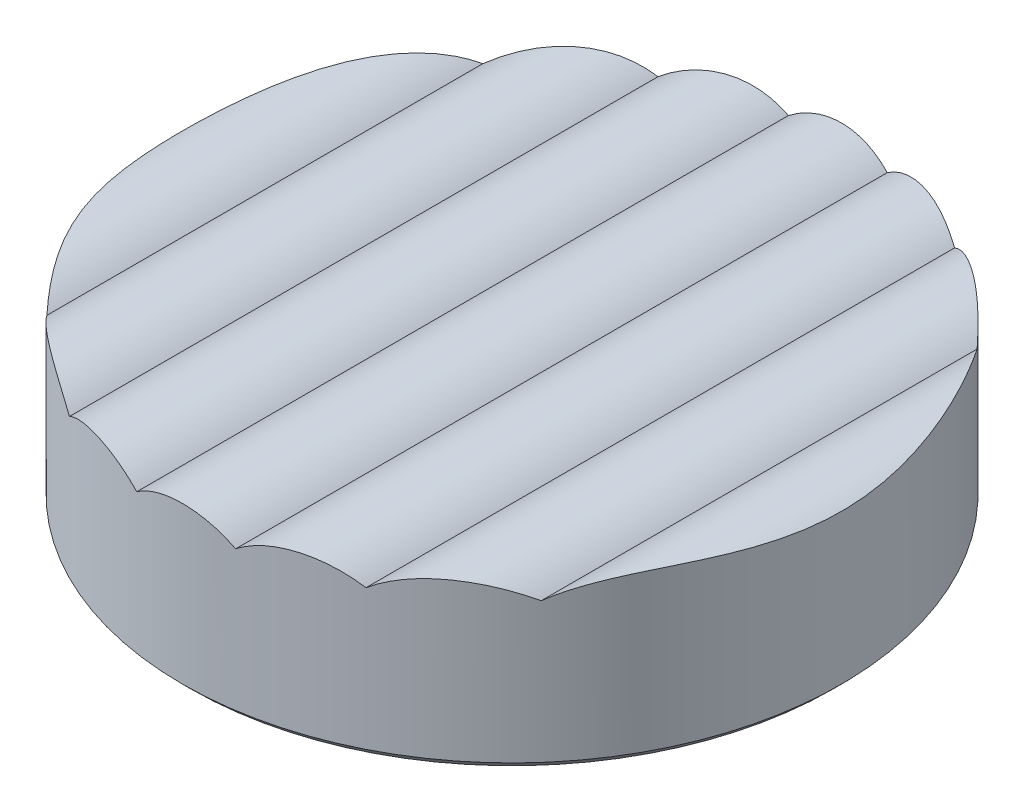
ISO-10303-21;
HEADER;
FILE_DESCRIPTION(('STEP AP214'),'2;1');
FILE_NAME('part.step','',(''),(''),'','','');
FILE_SCHEMA(('AUTOMOTIVE_DESIGN { 1 0 10303 214 1 1 1 1 }'));
ENDSEC;
DATA;
#1=APPLICATION_CONTEXT('core data for automotive mechanical design processes');
#2=APPLICATION_PROTOCOL_DEFINITION('international standard','automotive_design',2000,#1);
#3=PRODUCT_CONTEXT('',#1,'mechanical');
#4=PRODUCT('Part','Part','',(#3));
#5=PRODUCT_RELATED_PRODUCT_CATEGORY('part','',(#4));
#6=PRODUCT_DEFINITION_FORMATION('','',#4);
#7=PRODUCT_DEFINITION_CONTEXT('part definition',#1,'design');
#8=PRODUCT_DEFINITION('design','',#6,#7);
#9=PRODUCT_DEFINITION_SHAPE('','',#8);
#10=(LENGTH_UNIT() NAMED_UNIT(*) SI_UNIT(.MILLI.,.METRE.));
#11=(NAMED_UNIT(*) PLANE_ANGLE_UNIT() SI_UNIT($,.RADIAN.));
#12=(NAMED_UNIT(*) SI_UNIT($,.STERADIAN.) SOLID_ANGLE_UNIT());
#13=UNCERTAINTY_MEASURE_WITH_UNIT(LENGTH_MEASURE(1.E-05),#10,'distance_accuracy_value','');
#14=(GEOMETRIC_REPRESENTATION_CONTEXT(3) GLOBAL_UNCERTAINTY_ASSIGNED_CONTEXT((#13)) GLOBAL_UNIT_ASSIGNED_CONTEXT((#10,
#11,#12)) REPRESENTATION_CONTEXT('',''));
#15=CARTESIAN_POINT('',(0.,0.,0.));
#16=DIRECTION('',(0.,0.,1.));
#17=DIRECTION('',(1.,0.,0.));
#18=AXIS2_PLACEMENT_3D('',#15,#16,#17);
#19=CARTESIAN_POINT('',(0.,2.,0.));
#20=DIRECTION('',(0.,-1.,0.));
#21=DIRECTION('',(0.,0.,-1.));
#22=AXIS2_PLACEMENT_3D('',#19,#20,#21);
#23=CYLINDRICAL_SURFACE('',#22,4.);
#24=CARTESIAN_POINT('',(0.,0.100000000000001,0.));
#25=DIRECTION('',(0.,1.,0.));
#26=DIRECTION('',(0.,0.,1.));
#27=AXIS2_PLACEMENT_3D('',#24,#25,#26);
#28=CIRCLE('',#27,4.);
#29=CARTESIAN_POINT('',(0.,0.100000000000001,4.));
#30=VERTEX_POINT('',#29);
#31=EDGE_CURVE('E43',#30,#30,#28,.T.);
#32=ORIENTED_EDGE('',*,*,#31,.T.);
#33=EDGE_LOOP('',(#32));
#34=FACE_BOUND('',#33,.T.);
#35=CARTESIAN_POINT('',(-0.600000000000006,1.8,3.95474398665704));
#36=CARTESIAN_POINT('',(-0.62232941467402,1.81674786786321,3.95135681522682));
#37=CARTESIAN_POINT('',(-0.645321420618863,1.83252928491137,3.94767419977861));
#38=CARTESIAN_POINT('',(-0.692457273765009,1.86207565364581,3.9396794860719));
#39=CARTESIAN_POINT('',(-0.71660093355104,1.87584093195587,3.93536749000244));
#40=CARTESIAN_POINT('',(-0.790345142406715,1.91390948997767,3.92145899899357));
#41=CARTESIAN_POINT('',(-0.841411243888484,1.93509905569148,3.91086775564437));
#42=CARTESIAN_POINT('',(-0.945708150151169,1.96868070112807,3.88696555055375));
#43=CARTESIAN_POINT('',(-0.998938881065597,1.98107308078286,3.87365468155541));
#44=CARTESIAN_POINT('',(-1.10601002951169,1.99704341166832,3.84445325279022));
#45=CARTESIAN_POINT('',(-1.15985053308358,2.00062010301943,3.82856232464433));
#46=CARTESIAN_POINT('',(-1.26821159182471,1.99918361827415,3.79406956151264));
#47=CARTESIAN_POINT('',(-1.32270797293017,1.99392337626185,3.77540350670449));
#48=CARTESIAN_POINT('',(-1.4295350405246,1.97481349408842,3.73626464396623));
#49=CARTESIAN_POINT('',(-1.48186391852533,1.96095682947294,3.71579037021977));
#50=CARTESIAN_POINT('',(-1.58064952709579,1.9261264054983,3.67481312390131));
#51=CARTESIAN_POINT('',(-1.62726942020847,1.90554843649911,3.65436407119772));
#52=CARTESIAN_POINT('',(-1.71666831436955,1.85768199892992,3.613240778344));
#53=CARTESIAN_POINT('',(-1.75945545517311,1.83040823492381,3.59256712526228));
#54=CARTESIAN_POINT('',(-1.80000000000001,1.79999999999999,3.57211421989835));
#55=B_SPLINE_CURVE_WITH_KNOTS('',3,(#35,#36,#37,#38,#39,#40,#41,#42,#43,#44,#45,#46,#47,#48,#49,
#50,#51,#52,#53,#54),.UNSPECIFIED.,.F.,.F.,(4,2,2,2,2,2,2,2,2,4),(0.,0.0842978724085016,
0.16858207303078,0.336584111740341,0.504580422299046,0.67260074038181,0.845397208673373,
1.01833506165842,1.18251845702741,1.34634446665896),.UNSPECIFIED.);
#56=CARTESIAN_POINT('',(-0.600000000000006,1.8,3.95474398665704));
#57=VERTEX_POINT('',#56);
#58=CARTESIAN_POINT('',(-1.80000000000001,1.79999999999999,3.57211421989835));
#59=VERTEX_POINT('',#58);
#60=EDGE_CURVE('E254',#57,#59,#55,.T.);
#61=ORIENTED_EDGE('',*,*,#60,.T.);
#62=CARTESIAN_POINT('',(-1.8,1.79999999999999,3.57211421989835));
#63=CARTESIAN_POINT('',(-1.82419383073003,1.81814746587049,3.55992498858284));
#64=CARTESIAN_POINT('',(-1.84899294122477,1.83502924581072,3.54711784746098));
#65=CARTESIAN_POINT('',(-1.89950402563079,1.86624714952607,3.52032656296078));
#66=CARTESIAN_POINT('',(-1.92521514897336,1.88058557410132,3.50634350041667));
#67=CARTESIAN_POINT('',(-2.00293711991751,1.91960877689773,3.46290799234863));
#68=CARTESIAN_POINT('',(-2.05591792995748,1.94058079412006,3.43177980895558));
#69=CARTESIAN_POINT('',(-2.16216475679204,1.97289045409109,3.3658505444282));
#70=CARTESIAN_POINT('',(-2.21542925887783,1.98425961049609,3.33106190185304));
#71=CARTESIAN_POINT('',(-2.32105374800024,1.99830408419819,3.25834793166942));
#72=CARTESIAN_POINT('',(-2.37341187426008,2.00096323833908,3.22041690626434));
#73=CARTESIAN_POINT('',(-2.48431637042418,1.99822062499435,3.13588568428949));
#74=CARTESIAN_POINT('',(-2.5425088197709,1.99145794408126,3.08887066237391));
#75=CARTESIAN_POINT('',(-2.65511409351,1.96861757152844,2.99263540660609));
#76=CARTESIAN_POINT('',(-2.70952473531241,1.95253455003176,2.94341392585751));
#77=CARTESIAN_POINT('',(-2.80462950492763,1.91564117608675,2.85264241600385));
#78=CARTESIAN_POINT('',(-2.84604214981671,1.89618015171496,2.81128479000239));
#79=CARTESIAN_POINT('',(-2.92552942598229,1.85197567915462,2.72847706493548));
#80=CARTESIAN_POINT('',(-2.96361439857183,1.82724948140559,2.68702769505247));
#81=CARTESIAN_POINT('',(-3.00000000000001,1.79999999999998,2.64575131106458));
#82=B_SPLINE_CURVE_WITH_KNOTS('',3,(#62,#63,#64,#65,#66,#67,#68,#69,#70,#71,#72,#73,#74,#75,#76,
#77,#78,#79,#80,#81),.UNSPECIFIED.,.F.,.F.,(4,2,2,2,2,2,2,2,2,4),(0.,0.0977440746941684,
0.195399270962096,0.389203476285592,0.582369176629661,0.775893132198266,1.00044804934464,
1.22513150559945,1.4098580997834,1.59398853342984),.UNSPECIFIED.);
#83=CARTESIAN_POINT('',(-3.00000000000001,1.79999999999998,2.64575131106458));
#84=VERTEX_POINT('',#83);
#85=EDGE_CURVE('E232',#59,#84,#82,.T.);
#86=ORIENTED_EDGE('',*,*,#85,.T.);
#87=CARTESIAN_POINT('',(-3.00000000000001,1.79999999999998,2.64575131106458));
#88=CARTESIAN_POINT('',(-3.02532275092012,1.81898297437125,2.61704688694098));
#89=CARTESIAN_POINT('',(-3.05076706313692,1.83619940461668,2.5873554817303));
#90=CARTESIAN_POINT('',(-3.10150692265492,1.86740565335313,2.52630512950817));
#91=CARTESIAN_POINT('',(-3.12680266080136,1.88140154303974,2.4949494595804));
#92=CARTESIAN_POINT('',(-3.20143501705499,1.91881653282672,2.39943215754932));
#93=CARTESIAN_POINT('',(-3.25012971974909,1.93809368565252,2.33313143978897));
#94=CARTESIAN_POINT('',(-3.33687237068017,1.96566327792682,2.20686351577945));
#95=CARTESIAN_POINT('',(-3.37541060633351,1.97518364460663,2.14747527860394));
#96=CARTESIAN_POINT('',(-3.44952161463508,1.98933262178707,2.02628803236811));
#97=CARTESIAN_POINT('',(-3.48509295589765,1.9939588835461,1.96448788053829));
#98=CARTESIAN_POINT('',(-3.5531965246632,1.99949284200429,1.83846906982862));
#99=CARTESIAN_POINT('',(-3.58570270562235,2.00037106551433,1.77423523495239));
#100=CARTESIAN_POINT('',(-3.64719819543476,1.99935829875944,1.64411883640184));
#101=CARTESIAN_POINT('',(-3.67618638462862,1.99746642935624,1.57823575583328));
#102=CARTESIAN_POINT('',(-3.74556607469779,1.99026023076356,1.40826189250557));
#103=CARTESIAN_POINT('',(-3.78340521769221,1.98363224829508,1.30317905279292));
#104=CARTESIAN_POINT('',(-3.85015722497544,1.96880817539028,1.09029633746688));
#105=CARTESIAN_POINT('',(-3.87906567865454,1.96061131335568,0.982495147674203));
#106=CARTESIAN_POINT('',(-3.92771252216949,1.94512219611504,0.765135900374955));
#107=CARTESIAN_POINT('',(-3.94748020396065,1.93782710698741,0.655584635198466));
#108=CARTESIAN_POINT('',(-3.97782278722801,1.92602255784405,0.43509061476965));
#109=CARTESIAN_POINT('',(-3.98840062086589,1.92151220944718,0.324148314817562));
#110=CARTESIAN_POINT('',(-4.00025876454389,1.91642586725403,0.101669984372672));
#111=CARTESIAN_POINT('',(-4.00153911718843,1.91584985542921,-0.00986604339710964));
#112=CARTESIAN_POINT('',(-3.99478521860209,1.91878023041467,-0.232615125980815));
#113=CARTESIAN_POINT('',(-3.98674947082828,1.92228727312921,-0.343828126025989));
#114=CARTESIAN_POINT('',(-3.96142653649884,1.93249914292885,-0.565291360750933));
#115=CARTESIAN_POINT('',(-3.9441181211036,1.93921130396236,-0.675538793867225));
#116=CARTESIAN_POINT('',(-3.90038695866971,1.95409617359652,-0.894091752950589));
#117=CARTESIAN_POINT('',(-3.87396546235677,1.96226868169755,-1.00239754325393));
#118=CARTESIAN_POINT('',(-3.81874086248705,1.97610379384832,-1.19369677750131));
#119=CARTESIAN_POINT('',(-3.79164006567853,1.98193049154993,-1.27717365975343));
#120=CARTESIAN_POINT('',(-3.73196958589824,1.99171506776448,-1.44225602530675));
#121=CARTESIAN_POINT('',(-3.69940109294003,1.99567335221415,-1.5238619114367));
#122=CARTESIAN_POINT('',(-3.62897234823051,2.00020246025262,-1.68471140652661));
#123=CARTESIAN_POINT('',(-3.59112119271194,2.00077903490742,-1.76395879787826));
#124=CARTESIAN_POINT('',(-3.51035534015583,1.99679277437841,-1.91965777624241));
#125=CARTESIAN_POINT('',(-3.46744457906422,1.99223391082253,-1.99611147664733));
#126=CARTESIAN_POINT('',(-3.36917758101673,1.97449538183206,-2.15850339290627));
#127=CARTESIAN_POINT('',(-3.31295399922843,1.9599565644958,-2.24378410886497));
#128=CARTESIAN_POINT('',(-3.19607843063396,1.91689293851651,-2.40729081193502));
#129=CARTESIAN_POINT('',(-3.13545052970576,1.88843994575538,-2.48555060777778));
#130=CARTESIAN_POINT('',(-3.06212107090235,1.84314770151563,-2.57367500684651));
#131=CARTESIAN_POINT('',(-3.04968183071495,1.83509001977703,-2.5883991341227));
#132=CARTESIAN_POINT('',(-3.02481639809621,1.81816306588431,-2.6174121628991));
#133=CARTESIAN_POINT('',(-3.01239022812661,1.80929305545708,-2.63170065244002));
#134=CARTESIAN_POINT('',(-2.99999999999968,1.80000000000243,-2.64575131106557));
#135=B_SPLINE_CURVE_WITH_KNOTS('',3,(#87,#88,#89,#90,#91,#92,#93,#94,#95,#96,#97,#98,#99,#100,
#101,#102,#103,#104,#105,#106,#107,#108,#109,#110,#111,#112,#113,#114,#115,#116,#117,#118,#119,
#120,#121,#122,#123,#124,#125,#126,#127,#128,#129,#130,#131,#132,#133,#134),.UNSPECIFIED.,.F.,
.F.,(4,2,2,2,2,2,2,2,2,2,2,2,2,2,2,2,2,2,2,2,2,2,2,4),(0.,0.128053380280924,0.255863346341465,
0.508464758445938,0.722491335134044,0.936620579297172,1.15243058957271,1.36830910584166,
1.70350090393499,2.03885797991289,2.37313281387339,2.70730095312215,3.04146756109076,
3.37568785718634,3.71067660749811,4.04561940052741,4.30931011690571,4.57294351669621,
4.83612844106956,5.09910996402841,5.40774399516551,5.71480160890944,5.77746108708178,
5.8401780885042),.UNSPECIFIED.);
#136=CARTESIAN_POINT('',(-3.00000000000001,1.79999999999998,-2.64575131106458));
#137=VERTEX_POINT('',#136);
#138=EDGE_CURVE('E231',#84,#137,#135,.T.);
#139=ORIENTED_EDGE('',*,*,#138,.T.);
#140=CARTESIAN_POINT('',(-3.00000000000001,1.79999999999998,-2.64575131106458));
#141=CARTESIAN_POINT('',(-2.97506551177646,1.81868984845977,-2.67402628110174));
#142=CARTESIAN_POINT('',(-2.9493442942952,1.83617095025798,-2.70238302041516));
#143=CARTESIAN_POINT('',(-2.89636339979781,1.86867374204349,-2.75909128206226));
#144=CARTESIAN_POINT('',(-2.86910316425591,1.88369453134188,-2.78744279870684));
#145=CARTESIAN_POINT('',(-2.78476802571609,1.92514487079185,-2.87253460623489));
#146=CARTESIAN_POINT('',(-2.72543060190112,1.94774299037218,-2.92897800126589));
#147=CARTESIAN_POINT('',(-2.6028699911324,1.98122054303626,-3.03836776941551));
#148=CARTESIAN_POINT('',(-2.53975577026652,1.99233812010322,-3.09136289755331));
#149=CARTESIAN_POINT('',(-2.40978563987849,2.00206340231027,-3.19370193747555));
#150=CARTESIAN_POINT('',(-2.3429380604804,2.00069793286865,-3.24305344907163));
#151=CARTESIAN_POINT('',(-2.2201861114014,1.98526558786029,-3.32795304329386));
#152=CARTESIAN_POINT('',(-2.16457060221939,1.97361941183808,-3.36435737212451));
#153=CARTESIAN_POINT('',(-2.0539536939537,1.93998610698188,-3.43299894328624));
#154=CARTESIAN_POINT('',(-1.99895115038748,1.91802359401632,-3.46524587342162));
#155=CARTESIAN_POINT('',(-1.92037765800917,1.87792646061083,-3.50898560052015));
#156=CARTESIAN_POINT('',(-1.89567090217278,1.86398484339932,-3.52238355052124));
#157=CARTESIAN_POINT('',(-1.84712266296259,1.83375322801287,-3.54808293606736));
#158=CARTESIAN_POINT('',(-1.82328157710792,1.81746216761749,-3.56038387154162));
#159=CARTESIAN_POINT('',(-1.8,1.79999999999999,-3.57211421989835));
#160=B_SPLINE_CURVE_WITH_KNOTS('',3,(#140,#141,#142,#143,#144,#145,#146,#147,#148,#149,#150,
#151,#152,#153,#154,#155,#156,#157,#158,#159),.UNSPECIFIED.,.F.,.F.,(4,2,2,2,2,2,2,2,2,4),(0.,
0.126175619127698,0.252397326791968,0.506313160860678,0.754849180602281,1.00285123510904,
1.20451843665788,1.40570686455692,1.49972391449845,1.59378360507382),.UNSPECIFIED.);
#161=CARTESIAN_POINT('',(-1.80000000000001,1.79999999999999,-3.57211421989835));
#162=VERTEX_POINT('',#161);
#163=EDGE_CURVE('E249',#137,#162,#160,.T.);
#164=ORIENTED_EDGE('',*,*,#163,.T.);
#165=CARTESIAN_POINT('',(-1.80000000000001,1.79999999999999,-3.57211421989835));
#166=CARTESIAN_POINT('',(-1.75227156123367,1.83580346896344,-3.59621059781359));
#167=CARTESIAN_POINT('',(-1.70140908252971,1.86726712356151,-3.62059734840253));
#168=CARTESIAN_POINT('',(-1.59455131570657,1.92081983825646,-3.66889128701518));
#169=CARTESIAN_POINT('',(-1.5385417649097,1.94288183186804,-3.69279690415961));
#170=CARTESIAN_POINT('',(-1.42273217956607,1.97674614264018,-3.73894963955378));
#171=CARTESIAN_POINT('',(-1.36292697061972,1.98853411691379,-3.76119439973169));
#172=CARTESIAN_POINT('',(-1.24132341159941,2.00100899803634,-3.8030557274932));
#173=CARTESIAN_POINT('',(-1.17952774922556,2.0017102934007,-3.82267566880472));
#174=CARTESIAN_POINT('',(-1.05912273489741,1.99177317533639,-3.85771848005466));
#175=CARTESIAN_POINT('',(-1.00051327263593,1.98171720560232,-3.87330552178808));
#176=CARTESIAN_POINT('',(-0.885318053967095,1.95106074199438,-3.90124528419948));
#177=CARTESIAN_POINT('',(-0.828730500381032,1.93046987478255,-3.91360094212739));
#178=CARTESIAN_POINT('',(-0.74364433316159,1.89044313812726,-3.93039131847611));
#179=CARTESIAN_POINT('',(-0.713696931813514,1.87445018768265,-3.93592529472295));
#180=CARTESIAN_POINT('',(-0.655504473861233,1.83945011840746,-3.94603433072461));
#181=CARTESIAN_POINT('',(-0.627257132361761,1.82044717578746,-3.95061069898747));
#182=CARTESIAN_POINT('',(-0.600000000000006,1.8,-3.95474398665704));
#183=B_SPLINE_CURVE_WITH_KNOTS('',3,(#165,#166,#167,#168,#169,#170,#171,#172,#173,#174,#175,
#176,#177,#178,#179,#180,#181,#182),.UNSPECIFIED.,.F.,.F.,(4,2,2,2,2,2,2,2,4),(0.,
0.192857309553522,0.386266146301152,0.579944557982606,0.773371589251381,0.956831828954271,
1.14012472353053,1.24315081717614,1.34603519966624),.UNSPECIFIED.);
#184=CARTESIAN_POINT('',(-0.600000000000006,1.8,-3.95474398665704));
#185=VERTEX_POINT('',#184);
#186=EDGE_CURVE('E259',#162,#185,#183,.T.);
#187=ORIENTED_EDGE('',*,*,#186,.T.);
#188=CARTESIAN_POINT('',(-0.600000000000006,1.8,-3.95474398665704));
#189=CARTESIAN_POINT('',(-0.577844649172212,1.81661540894773,-3.95810564238813));
#190=CARTESIAN_POINT('',(-0.555001612618738,1.83230976205425,-3.96138020716267));
#191=CARTESIAN_POINT('',(-0.508063555079729,1.86176592977546,-3.9676734847896));
#192=CARTESIAN_POINT('',(-0.483968337981698,1.87552744041733,-3.97069215736901));
#193=CARTESIAN_POINT('',(-0.410050821978176,1.91374351278229,-3.97923439789681));
#194=CARTESIAN_POINT('',(-0.358550777217911,1.93516400795038,-3.98425140685193));
#195=CARTESIAN_POINT('',(-0.256355427043799,1.96796635764045,-3.99208257857569));
#196=CARTESIAN_POINT('',(-0.205861041415163,1.97995129829428,-3.99502749551122));
#197=CARTESIAN_POINT('',(-0.103578671135372,1.99596546825927,-3.99898570621672));
#198=CARTESIAN_POINT('',(-0.0517916337814237,2.00000035978003,-4.00000037473667));
#199=CARTESIAN_POINT('',(0.0552453962364944,1.99999961622778,-3.99999960027375));
#200=CARTESIAN_POINT('',(0.110496022372873,1.99540784916397,-3.99884426562491));
#201=CARTESIAN_POINT('',(0.219447729182588,1.97718869515677,-3.99434890951521));
#202=CARTESIAN_POINT('',(0.273147226500213,1.96355239381738,-3.99100673272172));
#203=CARTESIAN_POINT('',(0.374630217362695,1.92864034963019,-3.982724705952));
#204=CARTESIAN_POINT('',(0.422576506126463,1.90781184312188,-3.97787978926634));
#205=CARTESIAN_POINT('',(0.51451134041511,1.85906855273318,-3.96704728817116));
#206=CARTESIAN_POINT('',(0.558504309419477,1.83116182601872,-3.96106100489464));
#207=CARTESIAN_POINT('',(0.6,1.8,-3.95474398665704));
#208=B_SPLINE_CURVE_WITH_KNOTS('',3,(#188,#189,#190,#191,#192,#193,#194,#195,#196,#197,#198,
#199,#200,#201,#202,#203,#204,#205,#206,#207),.UNSPECIFIED.,.F.,.F.,(4,2,2,2,2,2,2,2,2,4),(0.,
0.0836402074522525,0.167293554076855,0.334429010320677,0.489737869630299,0.644936074321852,
0.810483783234882,0.976194900800988,1.13304965885972,1.28972666361723),.UNSPECIFIED.);
#209=CARTESIAN_POINT('',(0.6,1.8,-3.95474398665704));
#210=VERTEX_POINT('',#209);
#211=EDGE_CURVE('E95',#185,#210,#208,.T.);
#212=ORIENTED_EDGE('',*,*,#211,.T.);
#213=CARTESIAN_POINT('',(0.6,1.8,-3.95474398665704));
#214=CARTESIAN_POINT('',(0.622329414674014,1.81674786786321,-3.95135681522682));
#215=CARTESIAN_POINT('',(0.645321420618857,1.83252928491137,-3.94767419977861));
#216=CARTESIAN_POINT('',(0.692457273765003,1.86207565364581,-3.9396794860719));
#217=CARTESIAN_POINT('',(0.716600933551034,1.87584093195587,-3.93536749000245));
#218=CARTESIAN_POINT('',(0.790345142406708,1.91390948997768,-3.92145899899357));
#219=CARTESIAN_POINT('',(0.841411243888477,1.93509905569149,-3.91086775564437));
#220=CARTESIAN_POINT('',(0.945708150151162,1.96868070112808,-3.88696555055375));
#221=CARTESIAN_POINT('',(0.998938881065591,1.98107308078287,-3.87365468155541));
#222=CARTESIAN_POINT('',(1.10601002951168,1.99704341166833,-3.84445325279023));
#223=CARTESIAN_POINT('',(1.15985053308358,2.00062010301944,-3.82856232464434));
#224=CARTESIAN_POINT('',(1.2682115918247,1.99918361827416,-3.79406956151264));
#225=CARTESIAN_POINT('',(1.32270797293017,1.99392337626186,-3.77540350670449));
#226=CARTESIAN_POINT('',(1.4295350405246,1.97481349408843,-3.73626464396623));
#227=CARTESIAN_POINT('',(1.48186391852532,1.96095682947295,-3.71579037021977));
#228=CARTESIAN_POINT('',(1.58064952709579,1.92612640549831,-3.67481312390131));
#229=CARTESIAN_POINT('',(1.62726942020846,1.90554843649913,-3.65436407119772));
#230=CARTESIAN_POINT('',(1.71666831436954,1.85768199892993,-3.61324077834401));
#231=CARTESIAN_POINT('',(1.75945545517311,1.83040823492382,-3.59256712526229));
#232=CARTESIAN_POINT('',(1.8,1.8,-3.57211421989835));
#233=B_SPLINE_CURVE_WITH_KNOTS('',3,(#213,#214,#215,#216,#217,#218,#219,#220,#221,#222,#223,
#224,#225,#226,#227,#228,#229,#230,#231,#232),.UNSPECIFIED.,.F.,.F.,(4,2,2,2,2,2,2,2,2,4),(0.,
0.0842978724085011,0.16858207303078,0.336584111740341,0.504580422299046,0.67260074038181,
0.845397208673373,1.01833506165842,1.18251845702741,1.34634446665896),.UNSPECIFIED.);
#234=CARTESIAN_POINT('',(1.8,1.8,-3.57211421989835));
#235=VERTEX_POINT('',#234);
#236=EDGE_CURVE('E89',#210,#235,#233,.T.);
#237=ORIENTED_EDGE('',*,*,#236,.T.);
#238=CARTESIAN_POINT('',(1.8,1.8,-3.57211421989835));
#239=CARTESIAN_POINT('',(1.82419383073002,1.8181474658705,-3.55992498858284));
#240=CARTESIAN_POINT('',(1.84899294122477,1.83502924581073,-3.54711784746098));
#241=CARTESIAN_POINT('',(1.89950402563079,1.86624714952608,-3.52032656296078));
#242=CARTESIAN_POINT('',(1.92521514897335,1.88058557410134,-3.50634350041667));
#243=CARTESIAN_POINT('',(2.0029371199175,1.91960877689774,-3.46290799234863));
#244=CARTESIAN_POINT('',(2.05591792995747,1.94058079412007,-3.43177980895559));
#245=CARTESIAN_POINT('',(2.16216475679203,1.97289045409111,-3.3658505444282));
#246=CARTESIAN_POINT('',(2.21542925887782,1.9842596104961,-3.33106190185304));
#247=CARTESIAN_POINT('',(2.32105374800024,1.99830408419821,-3.25834793166942));
#248=CARTESIAN_POINT('',(2.37341187426007,2.00096323833909,-3.22041690626435));
#249=CARTESIAN_POINT('',(2.48431637042417,1.99822062499437,-3.13588568428949));
#250=CARTESIAN_POINT('',(2.5425088197709,1.99145794408128,-3.08887066237392));
#251=CARTESIAN_POINT('',(2.65511409350999,1.96861757152846,-2.9926354066061));
#252=CARTESIAN_POINT('',(2.7095247353124,1.95253455003178,-2.94341392585751));
#253=CARTESIAN_POINT('',(2.80462950492762,1.91564117608677,-2.85264241600385));
#254=CARTESIAN_POINT('',(2.8460421498167,1.89618015171498,-2.8112847900024));
#255=CARTESIAN_POINT('',(2.92552942598229,1.85197567915464,-2.72847706493548));
#256=CARTESIAN_POINT('',(2.96361439857182,1.82724948140561,-2.68702769505248));
#257=CARTESIAN_POINT('',(3.,1.8,-2.64575131106459));
#258=B_SPLINE_CURVE_WITH_KNOTS('',3,(#238,#239,#240,#241,#242,#243,#244,#245,#246,#247,#248,
#249,#250,#251,#252,#253,#254,#255,#256,#257),.UNSPECIFIED.,.F.,.F.,(4,2,2,2,2,2,2,2,2,4),(0.,
0.0977440746941683,0.195399270962096,0.389203476285591,0.582369176629659,0.775893132198265,
1.00044804934464,1.22513150559945,1.40985809978339,1.59398853342984),.UNSPECIFIED.);
#259=CARTESIAN_POINT('',(3.,1.8,-2.64575131106459));
#260=VERTEX_POINT('',#259);
#261=EDGE_CURVE('E92',#235,#260,#258,.T.);
#262=ORIENTED_EDGE('',*,*,#261,.T.);
#263=CARTESIAN_POINT('',(3.,1.8,-2.64575131106459));
#264=CARTESIAN_POINT('',(3.02532275092011,1.81898297437127,-2.61704688694099));
#265=CARTESIAN_POINT('',(3.05076706313691,1.8361994046167,-2.58735548173031));
#266=CARTESIAN_POINT('',(3.10150692265492,1.86740565335315,-2.52630512950818));
#267=CARTESIAN_POINT('',(3.12680266080135,1.88140154303977,-2.49494945958041));
#268=CARTESIAN_POINT('',(3.20143501705498,1.91881653282674,-2.39943215754932));
#269=CARTESIAN_POINT('',(3.25012971974908,1.93809368565254,-2.33313143978898));
#270=CARTESIAN_POINT('',(3.33687237068016,1.96566327792684,-2.20686351577946));
#271=CARTESIAN_POINT('',(3.3754106063335,1.97518364460666,-2.14747527860395));
#272=CARTESIAN_POINT('',(3.44952161463507,1.9893326217871,-2.02628803236812));
#273=CARTESIAN_POINT('',(3.48509295589764,1.99395888354612,-1.9644878805383));
#274=CARTESIAN_POINT('',(3.55319652466319,1.99949284200431,-1.83846906982864));
#275=CARTESIAN_POINT('',(3.58570270562234,2.00037106551436,-1.7742352349524));
#276=CARTESIAN_POINT('',(3.64719819543475,1.99935829875947,-1.64411883640186));
#277=CARTESIAN_POINT('',(3.67618638462861,1.99746642935627,-1.5782357558333));
#278=CARTESIAN_POINT('',(3.74556607469779,1.99026023076358,-1.40826189250559));
#279=CARTESIAN_POINT('',(3.78340521769221,1.98363224829511,-1.30317905279293));
#280=CARTESIAN_POINT('',(3.85015722497544,1.96880817539031,-1.09029633746689));
#281=CARTESIAN_POINT('',(3.87906567865454,1.96061131335571,-0.982495147674218));
#282=CARTESIAN_POINT('',(3.92771252216949,1.94512219611506,-0.765135900374971));
#283=CARTESIAN_POINT('',(3.94748020396064,1.93782710698743,-0.655584635198482));
#284=CARTESIAN_POINT('',(3.97782278722801,1.92602255784408,-0.435090614769666));
#285=CARTESIAN_POINT('',(3.98840062086589,1.9215122094472,-0.324148314817578));
#286=CARTESIAN_POINT('',(4.00025876454389,1.91642586725406,-0.101669984372688));
#287=CARTESIAN_POINT('',(4.00153911718843,1.91584985542923,0.00986604339709326));
#288=CARTESIAN_POINT('',(3.99478521860209,1.91878023041469,0.232615125980799));
#289=CARTESIAN_POINT('',(3.98674947082828,1.92228727312924,0.343828126025973));
#290=CARTESIAN_POINT('',(3.96142653649884,1.93249914292887,0.565291360750916));
#291=CARTESIAN_POINT('',(3.9441181211036,1.93921130396238,0.675538793867209));
#292=CARTESIAN_POINT('',(3.90038695866971,1.95409617359654,0.894091752950573));
#293=CARTESIAN_POINT('',(3.87396546235677,1.96226868169758,1.00239754325391));
#294=CARTESIAN_POINT('',(3.81874086248706,1.97610379384834,1.1936967775013));
#295=CARTESIAN_POINT('',(3.79164006567854,1.98193049154995,1.27717365975342));
#296=CARTESIAN_POINT('',(3.73196958589825,1.99171506776451,1.44225602530674));
#297=CARTESIAN_POINT('',(3.69940109294004,1.99567335221418,1.52386191143669));
#298=CARTESIAN_POINT('',(3.62897234823051,2.00020246025264,1.6847114065266));
#299=CARTESIAN_POINT('',(3.59112119271194,2.00077903490744,1.76395879787825));
#300=CARTESIAN_POINT('',(3.51035534015583,1.99679277437844,1.9196577762424));
#301=CARTESIAN_POINT('',(3.46744457906422,1.99223391082256,1.99611147664733));
#302=CARTESIAN_POINT('',(3.36917758101673,1.97449538183208,2.15850339290626));
#303=CARTESIAN_POINT('',(3.31295399922844,1.95995656449582,2.24378410886497));
#304=CARTESIAN_POINT('',(3.19607843063396,1.91689293851654,2.40729081193502));
#305=CARTESIAN_POINT('',(3.13545052970577,1.88843994575541,2.48555060777777));
#306=CARTESIAN_POINT('',(3.06212107090235,1.84314770151566,2.57367500684651));
#307=CARTESIAN_POINT('',(3.04968183071495,1.83509001977706,2.5883991341227));
#308=CARTESIAN_POINT('',(3.0248163980962,1.81816306588434,2.6174121628991));
#309=CARTESIAN_POINT('',(3.01239022812661,1.8092930554571,2.63170065244002));
#310=CARTESIAN_POINT('',(2.99999999999968,1.80000000000245,2.64575131106558));
#311=B_SPLINE_CURVE_WITH_KNOTS('',3,(#263,#264,#265,#266,#267,#268,#269,#270,#271,#272,#273,
#274,#275,#276,#277,#278,#279,#280,#281,#282,#283,#284,#285,#286,#287,#288,#289,#290,#291,#292,
#293,#294,#295,#296,#297,#298,#299,#300,#301,#302,#303,#304,#305,#306,#307,#308,#309,#310),
.UNSPECIFIED.,.F.,.F.,(4,2,2,2,2,2,2,2,2,2,2,2,2,2,2,2,2,2,2,2,2,2,2,4),(0.,0.128053380280924,
0.255863346341464,0.508464758445938,0.722491335134043,0.936620579297169,1.15243058957271,
1.36830910584166,1.70350090393499,2.03885797991288,2.37313281387338,2.70730095312214,
3.04146756109075,3.37568785718634,3.71067660749811,4.0456194005274,4.30931011690571,
4.57294351669621,4.83612844106956,5.09910996402841,5.40774399516551,5.71480160890944,
5.77746108708179,5.84017808850422),.UNSPECIFIED.);
#312=CARTESIAN_POINT('',(3.,1.8,2.64575131106459));
#313=VERTEX_POINT('',#312);
#314=EDGE_CURVE('E105',#260,#313,#311,.T.);
#315=ORIENTED_EDGE('',*,*,#314,.T.);
#316=CARTESIAN_POINT('',(3.,1.8,2.64575131106459));
#317=CARTESIAN_POINT('',(2.97506551177645,1.81868984845979,2.67402628110175));
#318=CARTESIAN_POINT('',(2.94934429429519,1.836170950258,2.70238302041517));
#319=CARTESIAN_POINT('',(2.8963633997978,1.86867374204351,2.75909128206227));
#320=CARTESIAN_POINT('',(2.86910316425591,1.8836945313419,2.78744279870684));
#321=CARTESIAN_POINT('',(2.78476802571608,1.92514487079187,2.8725346062349));
#322=CARTESIAN_POINT('',(2.72543060190111,1.9477429903722,2.9289780012659));
#323=CARTESIAN_POINT('',(2.60286999113239,1.98122054303627,3.03836776941552));
#324=CARTESIAN_POINT('',(2.53975577026651,1.99233812010324,3.09136289755331));
#325=CARTESIAN_POINT('',(2.40978563987848,2.00206340231029,3.19370193747555));
#326=CARTESIAN_POINT('',(2.34293806048039,2.00069793286866,3.24305344907164));
#327=CARTESIAN_POINT('',(2.22018611140139,1.98526558786031,3.32795304329386));
#328=CARTESIAN_POINT('',(2.16457060221938,1.9736194118381,3.36435737212451));
#329=CARTESIAN_POINT('',(2.05395369395369,1.9399861069819,3.43299894328625));
#330=CARTESIAN_POINT('',(1.99895115038748,1.91802359401633,3.46524587342162));
#331=CARTESIAN_POINT('',(1.92037765800916,1.87792646061084,3.50898560052015));
#332=CARTESIAN_POINT('',(1.89567090217278,1.86398484339934,3.52238355052124));
#333=CARTESIAN_POINT('',(1.84712266296258,1.83375322801289,3.54808293606736));
#334=CARTESIAN_POINT('',(1.82328157710792,1.81746216761751,3.56038387154162));
#335=CARTESIAN_POINT('',(1.8,1.8,3.57211421989835));
#336=B_SPLINE_CURVE_WITH_KNOTS('',3,(#316,#317,#318,#319,#320,#321,#322,#323,#324,#325,#326,
#327,#328,#329,#330,#331,#332,#333,#334,#335),.UNSPECIFIED.,.F.,.F.,(4,2,2,2,2,2,2,2,2,4),(0.,
0.126175619127698,0.252397326791968,0.506313160860678,0.75484918060228,1.00285123510903,
1.20451843665788,1.40570686455692,1.49972391449845,1.59378360507382),.UNSPECIFIED.);
#337=CARTESIAN_POINT('',(1.8,1.8,3.57211421989835));
#338=VERTEX_POINT('',#337);
#339=EDGE_CURVE('E106',#313,#338,#336,.T.);
#340=ORIENTED_EDGE('',*,*,#339,.T.);
#341=CARTESIAN_POINT('',(1.8,1.8,3.57211421989835));
#342=CARTESIAN_POINT('',(1.75227156123366,1.83580346896345,3.59621059781359));
#343=CARTESIAN_POINT('',(1.70140908252971,1.86726712356153,3.62059734840253));
#344=CARTESIAN_POINT('',(1.59455131570656,1.92081983825647,3.66889128701518));
#345=CARTESIAN_POINT('',(1.53854176490969,1.94288183186805,3.69279690415962));
#346=CARTESIAN_POINT('',(1.42273217956606,1.97674614264019,3.73894963955378));
#347=CARTESIAN_POINT('',(1.36292697061971,1.98853411691379,3.76119439973169));
#348=CARTESIAN_POINT('',(1.2413234115994,2.00100899803635,3.8030557274932));
#349=CARTESIAN_POINT('',(1.17952774922555,2.0017102934007,3.82267566880472));
#350=CARTESIAN_POINT('',(1.0591227348974,1.9917731753364,3.85771848005467));
#351=CARTESIAN_POINT('',(1.00051327263592,1.98171720560233,3.87330552178808));
#352=CARTESIAN_POINT('',(0.885318053967088,1.95106074199438,3.90124528419948));
#353=CARTESIAN_POINT('',(0.828730500381025,1.93046987478256,3.91360094212739));
#354=CARTESIAN_POINT('',(0.743644333161583,1.89044313812726,3.93039131847611));
#355=CARTESIAN_POINT('',(0.713696931813508,1.87445018768265,3.93592529472295));
#356=CARTESIAN_POINT('',(0.655504473861227,1.83945011840746,3.94603433072462));
#357=CARTESIAN_POINT('',(0.627257132361755,1.82044717578746,3.95061069898747));
#358=CARTESIAN_POINT('',(0.6,1.8,3.95474398665704));
#359=B_SPLINE_CURVE_WITH_KNOTS('',3,(#341,#342,#343,#344,#345,#346,#347,#348,#349,#350,#351,
#352,#353,#354,#355,#356,#357,#358),.UNSPECIFIED.,.F.,.F.,(4,2,2,2,2,2,2,2,4),(0.,
0.192857309553522,0.386266146301152,0.579944557982606,0.773371589251381,0.956831828954271,
1.14012472353053,1.24315081717614,1.34603519966624),.UNSPECIFIED.);
#360=CARTESIAN_POINT('',(0.6,1.8,3.95474398665704));
#361=VERTEX_POINT('',#360);
#362=EDGE_CURVE('E50',#338,#361,#359,.T.);
#363=ORIENTED_EDGE('',*,*,#362,.T.);
#364=CARTESIAN_POINT('',(0.6,1.8,3.95474398665704));
#365=CARTESIAN_POINT('',(0.555748083623549,1.83324392726595,3.96148685493457));
#366=CARTESIAN_POINT('',(0.50864158254436,1.8627773101345,3.96784679954796));
#367=CARTESIAN_POINT('',(0.410050429627863,1.91373752560551,3.97922844337354));
#368=CARTESIAN_POINT('',(0.35856334581562,1.9351598187189,3.98424939273426));
#369=CARTESIAN_POINT('',(0.252532325219628,1.96919364030805,3.99237659292749));
#370=CARTESIAN_POINT('',(0.197984869908501,1.98179479317057,3.99548058849457));
#371=CARTESIAN_POINT('',(0.0875183888704903,1.99772229328175,3.9994232823102));
#372=CARTESIAN_POINT('',(0.0316006421962479,2.00105698051794,4.00026401751292));
#373=CARTESIAN_POINT('',(-0.0789833918831667,1.99838190164211,3.99959571883021));
#374=CARTESIAN_POINT('',(-0.133654088525756,1.99253925136966,3.99812870741401));
#375=CARTESIAN_POINT('',(-0.241246307009634,1.97200896503076,3.99308207058832));
#376=CARTESIAN_POINT('',(-0.294166699854011,1.95731573309369,3.98950110864065));
#377=CARTESIAN_POINT('',(-0.391069259976611,1.92164364580956,3.98110017065801));
#378=CARTESIAN_POINT('',(-0.435392728282676,1.90153945625326,3.976460978443));
#379=CARTESIAN_POINT('',(-0.520526221877169,1.85522431108716,3.96622237645363));
#380=CARTESIAN_POINT('',(-0.561341008236728,1.82902181552116,3.96062429973332));
#381=CARTESIAN_POINT('',(-0.600000000000006,1.8,3.95474398665704));
#382=B_SPLINE_CURVE_WITH_KNOTS('',3,(#364,#365,#366,#367,#368,#369,#370,#371,#372,#373,#374,
#375,#376,#377,#378,#379,#380,#381),.UNSPECIFIED.,.F.,.F.,(4,2,2,2,2,2,2,2,4),(0.,
0.167095568274375,0.334284516260325,0.501669786518478,0.668904358121329,0.833128777815011,
0.997457139221825,1.14361521393286,1.28957172284405),.UNSPECIFIED.);
#383=EDGE_CURVE('E58',#361,#57,#382,.T.);
#384=ORIENTED_EDGE('',*,*,#383,.T.);
#385=EDGE_LOOP('',(#61,#86,#139,#164,#187,#212,#237,#262,#315,#340,#363,#384));
#386=FACE_BOUND('',#385,.T.);
#387=ADVANCED_FACE('F35',(#34,#386),#23,.T.);
#388=CARTESIAN_POINT('',(0.,0.,0.));
#389=DIRECTION('',(0.,1.,0.));
#390=DIRECTION('',(0.,0.,1.));
#391=AXIS2_PLACEMENT_3D('',#388,#389,#390);
#392=PLANE('',#391);
#393=CARTESIAN_POINT('',(0.,0.,0.));
#394=DIRECTION('',(0.,1.,0.));
#395=DIRECTION('',(0.,0.,1.));
#396=AXIS2_PLACEMENT_3D('',#393,#394,#395);
#397=CIRCLE('',#396,3.9);
#398=CARTESIAN_POINT('',(0.,0.,3.9));
#399=VERTEX_POINT('',#398);
#400=EDGE_CURVE('E11',#399,#399,#397,.F.);
#401=ORIENTED_EDGE('',*,*,#400,.T.);
#402=EDGE_LOOP('',(#401));
#403=FACE_BOUND('',#402,.T.);
#404=ADVANCED_FACE('F136',(#403),#392,.F.);
#405=CARTESIAN_POINT('',(1.2,1.,-4.));
#406=DIRECTION('',(0.,0.,1.));
#407=DIRECTION('',(1.,0.,0.));
#408=AXIS2_PLACEMENT_3D('',#405,#406,#407);
#409=CYLINDRICAL_SURFACE('',#408,1.);
#410=DIRECTION('',(0.,0.,1.));
#411=VECTOR('',#410,1.);
#412=CARTESIAN_POINT('',(0.6,1.8,-4.));
#413=LINE('',#412,#411);
#414=EDGE_CURVE('E118',#210,#361,#413,.T.);
#415=ORIENTED_EDGE('',*,*,#414,.T.);
#416=ORIENTED_EDGE('',*,*,#362,.F.);
#417=DIRECTION('',(0.,0.,1.));
#418=VECTOR('',#417,1.);
#419=CARTESIAN_POINT('',(1.8,1.8,-4.));
#420=LINE('',#419,#418);
#421=EDGE_CURVE('E101',#235,#338,#420,.T.);
#422=ORIENTED_EDGE('',*,*,#421,.F.);
#423=ORIENTED_EDGE('',*,*,#236,.F.);
#424=EDGE_LOOP('',(#415,#416,#422,#423));
#425=FACE_BOUND('',#424,.T.);
#426=ADVANCED_FACE('F108',(#425),#409,.T.);
#427=CARTESIAN_POINT('',(0.,1.,-4.));
#428=DIRECTION('',(0.,0.,1.));
#429=DIRECTION('',(1.,0.,0.));
#430=AXIS2_PLACEMENT_3D('',#427,#428,#429);
#431=CYLINDRICAL_SURFACE('',#430,1.);
#432=ORIENTED_EDGE('',*,*,#211,.F.);
#433=DIRECTION('',(0.,0.,1.));
#434=VECTOR('',#433,1.);
#435=CARTESIAN_POINT('',(-0.600000000000006,1.8,-4.));
#436=LINE('',#435,#434);
#437=EDGE_CURVE('E277',#185,#57,#436,.T.);
#438=ORIENTED_EDGE('',*,*,#437,.T.);
#439=ORIENTED_EDGE('',*,*,#383,.F.);
#440=ORIENTED_EDGE('',*,*,#414,.F.);
#441=EDGE_LOOP('',(#432,#438,#439,#440));
#442=FACE_BOUND('',#441,.T.);
#443=ADVANCED_FACE('F135',(#442),#431,.T.);
#444=CARTESIAN_POINT('',(-1.2,0.999999999999992,-4.));
#445=DIRECTION('',(0.,0.,1.));
#446=DIRECTION('',(1.,0.,0.));
#447=AXIS2_PLACEMENT_3D('',#444,#445,#446);
#448=CYLINDRICAL_SURFACE('',#447,1.);
#449=DIRECTION('',(0.,0.,1.));
#450=VECTOR('',#449,1.);
#451=CARTESIAN_POINT('',(-1.80000000000001,1.79999999999999,-4.));
#452=LINE('',#451,#450);
#453=EDGE_CURVE('E279',#162,#59,#452,.T.);
#454=ORIENTED_EDGE('',*,*,#453,.T.);
#455=ORIENTED_EDGE('',*,*,#60,.F.);
#456=ORIENTED_EDGE('',*,*,#437,.F.);
#457=ORIENTED_EDGE('',*,*,#186,.F.);
#458=EDGE_LOOP('',(#454,#455,#456,#457));
#459=FACE_BOUND('',#458,.T.);
#460=ADVANCED_FACE('F172',(#459),#448,.T.);
#461=CARTESIAN_POINT('',(-2.4,0.999999999999983,-4.));
#462=DIRECTION('',(0.,0.,1.));
#463=DIRECTION('',(1.,0.,0.));
#464=AXIS2_PLACEMENT_3D('',#461,#462,#463);
#465=CYLINDRICAL_SURFACE('',#464,1.);
#466=DIRECTION('',(0.,0.,1.));
#467=VECTOR('',#466,1.);
#468=CARTESIAN_POINT('',(-3.00000000000001,1.79999999999998,-4.));
#469=LINE('',#468,#467);
#470=EDGE_CURVE('E110',#137,#84,#469,.T.);
#471=ORIENTED_EDGE('',*,*,#470,.T.);
#472=ORIENTED_EDGE('',*,*,#85,.F.);
#473=ORIENTED_EDGE('',*,*,#453,.F.);
#474=ORIENTED_EDGE('',*,*,#163,.F.);
#475=EDGE_LOOP('',(#471,#472,#473,#474));
#476=FACE_BOUND('',#475,.T.);
#477=ADVANCED_FACE('F179',(#476),#465,.T.);
#478=CARTESIAN_POINT('',(-3.6,0.999999999999975,-4.));
#479=DIRECTION('',(0.,0.,1.));
#480=DIRECTION('',(1.,0.,0.));
#481=AXIS2_PLACEMENT_3D('',#478,#479,#480);
#482=CYLINDRICAL_SURFACE('',#481,1.);
#483=ORIENTED_EDGE('',*,*,#470,.F.);
#484=ORIENTED_EDGE('',*,*,#138,.F.);
#485=EDGE_LOOP('',(#483,#484));
#486=FACE_BOUND('',#485,.T.);
#487=ADVANCED_FACE('F187',(#486),#482,.T.);
#488=CARTESIAN_POINT('',(3.6,1.,-4.));
#489=DIRECTION('',(0.,0.,1.));
#490=DIRECTION('',(1.,0.,0.));
#491=AXIS2_PLACEMENT_3D('',#488,#489,#490);
#492=CYLINDRICAL_SURFACE('',#491,1.);
#493=DIRECTION('',(0.,0.,1.));
#494=VECTOR('',#493,1.);
#495=CARTESIAN_POINT('',(3.,1.8,-4.));
#496=LINE('',#495,#494);
#497=EDGE_CURVE('E104',#260,#313,#496,.T.);
#498=ORIENTED_EDGE('',*,*,#497,.T.);
#499=ORIENTED_EDGE('',*,*,#314,.F.);
#500=EDGE_LOOP('',(#498,#499));
#501=FACE_BOUND('',#500,.T.);
#502=ADVANCED_FACE('F129',(#501),#492,.T.);
#503=CARTESIAN_POINT('',(2.4,1.,-4.));
#504=DIRECTION('',(0.,0.,1.));
#505=DIRECTION('',(1.,0.,0.));
#506=AXIS2_PLACEMENT_3D('',#503,#504,#505);
#507=CYLINDRICAL_SURFACE('',#506,1.);
#508=ORIENTED_EDGE('',*,*,#421,.T.);
#509=ORIENTED_EDGE('',*,*,#339,.F.);
#510=ORIENTED_EDGE('',*,*,#497,.F.);
#511=ORIENTED_EDGE('',*,*,#261,.F.);
#512=EDGE_LOOP('',(#508,#509,#510,#511));
#513=FACE_BOUND('',#512,.T.);
#514=ADVANCED_FACE('F99',(#513),#507,.T.);
#515=CARTESIAN_POINT('',(0.,0.100000000000001,0.));
#516=DIRECTION('',(0.,1.,0.));
#517=DIRECTION('',(0.,0.,1.));
#518=AXIS2_PLACEMENT_3D('',#515,#516,#517);
#519=CONICAL_SURFACE('',#518,4.,0.785398163397453);
#520=ORIENTED_EDGE('',*,*,#400,.F.);
#521=EDGE_LOOP('',(#520));
#522=FACE_BOUND('',#521,.T.);
#523=ORIENTED_EDGE('',*,*,#31,.F.);
#524=EDGE_LOOP('',(#523));
#525=FACE_BOUND('',#524,.T.);
#526=ADVANCED_FACE('F37',(#522,#525),#519,.T.);
#527=CLOSED_SHELL('',(#387,#404,#426,#443,#460,#477,#487,#502,#514,#526));
#528=MANIFOLD_SOLID_BREP('B2',#527);
#529=ADVANCED_BREP_SHAPE_REPRESENTATION('',(#18,#528),#14);
#530=SHAPE_DEFINITION_REPRESENTATION(#9,#529);
ENDSEC;
END-ISO-10303-21;
